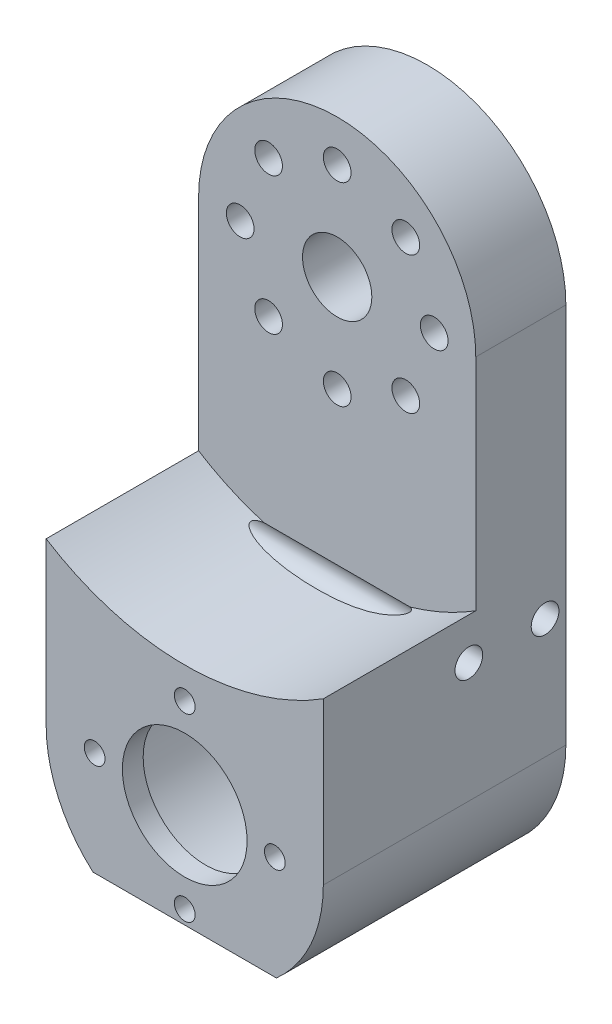
ISO-10303-21;
HEADER;
FILE_DESCRIPTION(('STEP AP214'),'2;1');
FILE_NAME('part.step','',(''),(''),'','','');
FILE_SCHEMA(('AUTOMOTIVE_DESIGN { 1 0 10303 214 1 1 1 1 }'));
ENDSEC;
DATA;
#1=APPLICATION_CONTEXT('core data for automotive mechanical design processes');
#2=APPLICATION_PROTOCOL_DEFINITION('international standard','automotive_design',2000,#1);
#3=PRODUCT_CONTEXT('',#1,'mechanical');
#4=PRODUCT('Part','Part','',(#3));
#5=PRODUCT_RELATED_PRODUCT_CATEGORY('part','',(#4));
#6=PRODUCT_DEFINITION_FORMATION('','',#4);
#7=PRODUCT_DEFINITION_CONTEXT('part definition',#1,'design');
#8=PRODUCT_DEFINITION('design','',#6,#7);
#9=PRODUCT_DEFINITION_SHAPE('','',#8);
#10=(LENGTH_UNIT() NAMED_UNIT(*) SI_UNIT(.MILLI.,.METRE.));
#11=(NAMED_UNIT(*) PLANE_ANGLE_UNIT() SI_UNIT($,.RADIAN.));
#12=(NAMED_UNIT(*) SI_UNIT($,.STERADIAN.) SOLID_ANGLE_UNIT());
#13=UNCERTAINTY_MEASURE_WITH_UNIT(LENGTH_MEASURE(1.E-05),#10,'distance_accuracy_value','');
#14=(GEOMETRIC_REPRESENTATION_CONTEXT(3) GLOBAL_UNCERTAINTY_ASSIGNED_CONTEXT((#13)) GLOBAL_UNIT_ASSIGNED_CONTEXT((#10,
#11,#12)) REPRESENTATION_CONTEXT('',''));
#15=CARTESIAN_POINT('',(0.,0.,0.));
#16=DIRECTION('',(0.,0.,1.));
#17=DIRECTION('',(1.,0.,0.));
#18=AXIS2_PLACEMENT_3D('',#15,#16,#17);
#19=CARTESIAN_POINT('',(0.,-75.,35.));
#20=DIRECTION('',(0.,0.,-1.));
#21=DIRECTION('',(-1.,0.,0.));
#22=AXIS2_PLACEMENT_3D('',#19,#20,#21);
#23=CYLINDRICAL_SURFACE('',#22,8.99999999999999);
#24=CARTESIAN_POINT('',(0.,-75.,35.));
#25=DIRECTION('',(0.,0.,1.));
#26=DIRECTION('',(1.,0.,0.));
#27=AXIS2_PLACEMENT_3D('',#24,#25,#26);
#28=CIRCLE('',#27,8.99999999999999);
#29=CARTESIAN_POINT('',(8.99999999999999,-75.,35.));
#30=VERTEX_POINT('',#29);
#31=EDGE_CURVE('E122',#30,#30,#28,.T.);
#32=ORIENTED_EDGE('',*,*,#31,.T.);
#33=EDGE_LOOP('',(#32));
#34=FACE_BOUND('',#33,.T.);
#35=CARTESIAN_POINT('',(0.,-75.,32.));
#36=DIRECTION('',(0.,0.,-1.));
#37=DIRECTION('',(-1.,0.,0.));
#38=AXIS2_PLACEMENT_3D('',#35,#36,#37);
#39=CIRCLE('',#38,8.99999999999999);
#40=CARTESIAN_POINT('',(-8.99999999999999,-75.,32.));
#41=VERTEX_POINT('',#40);
#42=EDGE_CURVE('E234',#41,#41,#39,.T.);
#43=ORIENTED_EDGE('',*,*,#42,.T.);
#44=EDGE_LOOP('',(#43));
#45=FACE_BOUND('',#44,.T.);
#46=ADVANCED_FACE('F33',(#34,#45),#23,.F.);
#47=CARTESIAN_POINT('',(0.,-62.,35.));
#48=DIRECTION('',(0.,0.,-1.));
#49=DIRECTION('',(-1.,0.,0.));
#50=AXIS2_PLACEMENT_3D('',#47,#48,#49);
#51=CYLINDRICAL_SURFACE('',#50,1.5);
#52=CARTESIAN_POINT('',(0.,-62.,35.));
#53=DIRECTION('',(0.,0.,1.));
#54=DIRECTION('',(1.,0.,0.));
#55=AXIS2_PLACEMENT_3D('',#52,#53,#54);
#56=CIRCLE('',#55,1.5);
#57=CARTESIAN_POINT('',(1.5,-62.,35.));
#58=VERTEX_POINT('',#57);
#59=EDGE_CURVE('E222',#58,#58,#56,.T.);
#60=ORIENTED_EDGE('',*,*,#59,.T.);
#61=EDGE_LOOP('',(#60));
#62=FACE_BOUND('',#61,.T.);
#63=CARTESIAN_POINT('',(0.,-62.,32.));
#64=DIRECTION('',(0.,0.,-1.));
#65=DIRECTION('',(-1.,0.,0.));
#66=AXIS2_PLACEMENT_3D('',#63,#64,#65);
#67=CIRCLE('',#66,1.5);
#68=CARTESIAN_POINT('',(-1.5,-62.,32.));
#69=VERTEX_POINT('',#68);
#70=EDGE_CURVE('E237',#69,#69,#67,.T.);
#71=ORIENTED_EDGE('',*,*,#70,.T.);
#72=EDGE_LOOP('',(#71));
#73=FACE_BOUND('',#72,.T.);
#74=ADVANCED_FACE('F274',(#62,#73),#51,.F.);
#75=CARTESIAN_POINT('',(0.,-88.,35.));
#76=DIRECTION('',(0.,0.,-1.));
#77=DIRECTION('',(-1.,0.,0.));
#78=AXIS2_PLACEMENT_3D('',#75,#76,#77);
#79=CYLINDRICAL_SURFACE('',#78,1.5);
#80=CARTESIAN_POINT('',(0.,-88.,35.));
#81=DIRECTION('',(0.,0.,1.));
#82=DIRECTION('',(1.,0.,0.));
#83=AXIS2_PLACEMENT_3D('',#80,#81,#82);
#84=CIRCLE('',#83,1.5);
#85=CARTESIAN_POINT('',(1.5,-88.,35.));
#86=VERTEX_POINT('',#85);
#87=EDGE_CURVE('E225',#86,#86,#84,.T.);
#88=ORIENTED_EDGE('',*,*,#87,.T.);
#89=EDGE_LOOP('',(#88));
#90=FACE_BOUND('',#89,.T.);
#91=CARTESIAN_POINT('',(0.,-88.,32.));
#92=DIRECTION('',(0.,0.,-1.));
#93=DIRECTION('',(-1.,0.,0.));
#94=AXIS2_PLACEMENT_3D('',#91,#92,#93);
#95=CIRCLE('',#94,1.5);
#96=CARTESIAN_POINT('',(-1.5,-88.,32.));
#97=VERTEX_POINT('',#96);
#98=EDGE_CURVE('E240',#97,#97,#95,.T.);
#99=ORIENTED_EDGE('',*,*,#98,.T.);
#100=EDGE_LOOP('',(#99));
#101=FACE_BOUND('',#100,.T.);
#102=ADVANCED_FACE('F280',(#90,#101),#79,.F.);
#103=CARTESIAN_POINT('',(-13.,-75.,35.));
#104=DIRECTION('',(0.,0.,-1.));
#105=DIRECTION('',(-1.,0.,0.));
#106=AXIS2_PLACEMENT_3D('',#103,#104,#105);
#107=CYLINDRICAL_SURFACE('',#106,1.5);
#108=CARTESIAN_POINT('',(-13.,-75.,35.));
#109=DIRECTION('',(0.,0.,1.));
#110=DIRECTION('',(1.,0.,0.));
#111=AXIS2_PLACEMENT_3D('',#108,#109,#110);
#112=CIRCLE('',#111,1.5);
#113=CARTESIAN_POINT('',(-11.5,-75.,35.));
#114=VERTEX_POINT('',#113);
#115=EDGE_CURVE('E228',#114,#114,#112,.T.);
#116=ORIENTED_EDGE('',*,*,#115,.T.);
#117=EDGE_LOOP('',(#116));
#118=FACE_BOUND('',#117,.T.);
#119=CARTESIAN_POINT('',(-13.,-75.,32.));
#120=DIRECTION('',(0.,0.,-1.));
#121=DIRECTION('',(-1.,0.,0.));
#122=AXIS2_PLACEMENT_3D('',#119,#120,#121);
#123=CIRCLE('',#122,1.5);
#124=CARTESIAN_POINT('',(-14.5,-75.,32.));
#125=VERTEX_POINT('',#124);
#126=EDGE_CURVE('E243',#125,#125,#123,.T.);
#127=ORIENTED_EDGE('',*,*,#126,.T.);
#128=EDGE_LOOP('',(#127));
#129=FACE_BOUND('',#128,.T.);
#130=ADVANCED_FACE('F392',(#118,#129),#107,.F.);
#131=CARTESIAN_POINT('',(13.,-75.,35.));
#132=DIRECTION('',(0.,0.,-1.));
#133=DIRECTION('',(-1.,0.,0.));
#134=AXIS2_PLACEMENT_3D('',#131,#132,#133);
#135=CYLINDRICAL_SURFACE('',#134,1.5);
#136=CARTESIAN_POINT('',(13.,-75.,35.));
#137=DIRECTION('',(0.,0.,1.));
#138=DIRECTION('',(1.,0.,0.));
#139=AXIS2_PLACEMENT_3D('',#136,#137,#138);
#140=CIRCLE('',#139,1.5);
#141=CARTESIAN_POINT('',(14.5,-75.,35.));
#142=VERTEX_POINT('',#141);
#143=EDGE_CURVE('E231',#142,#142,#140,.T.);
#144=ORIENTED_EDGE('',*,*,#143,.T.);
#145=EDGE_LOOP('',(#144));
#146=FACE_BOUND('',#145,.T.);
#147=CARTESIAN_POINT('',(13.,-75.,32.));
#148=DIRECTION('',(0.,0.,-1.));
#149=DIRECTION('',(-1.,0.,0.));
#150=AXIS2_PLACEMENT_3D('',#147,#148,#149);
#151=CIRCLE('',#150,1.5);
#152=CARTESIAN_POINT('',(11.5,-75.,32.));
#153=VERTEX_POINT('',#152);
#154=EDGE_CURVE('E246',#153,#153,#151,.T.);
#155=ORIENTED_EDGE('',*,*,#154,.T.);
#156=EDGE_LOOP('',(#155));
#157=FACE_BOUND('',#156,.T.);
#158=ADVANCED_FACE('F336',(#146,#157),#135,.F.);
#159=CARTESIAN_POINT('',(0.,-20.,13.));
#160=DIRECTION('',(0.,0.,1.));
#161=DIRECTION('',(1.,0.,0.));
#162=AXIS2_PLACEMENT_3D('',#159,#160,#161);
#163=PLANE('',#162);
#164=DIRECTION('',(-1.,0.,0.));
#165=VECTOR('',#164,1.);
#166=CARTESIAN_POINT('',(20.00105,-55.9893930435549,13.));
#167=LINE('',#166,#165);
#168=CARTESIAN_POINT('',(-10.53629860798,-55.9893930435549,13.));
#169=VERTEX_POINT('',#168);
#170=CARTESIAN_POINT('',(10.53629860798,-55.9893930435549,13.));
#171=VERTEX_POINT('',#170);
#172=EDGE_CURVE('E49',#169,#171,#167,.F.);
#173=ORIENTED_EDGE('',*,*,#172,.T.);
#174=CARTESIAN_POINT('',(0.,-20.,13.));
#175=DIRECTION('',(0.,0.,-1.));
#176=DIRECTION('',(1.,0.,0.));
#177=AXIS2_PLACEMENT_3D('',#174,#175,#176);
#178=CIRCLE('',#177,37.5);
#179=CARTESIAN_POINT('',(20.,-51.7214438511238,13.));
#180=VERTEX_POINT('',#179);
#181=EDGE_CURVE('E107',#180,#171,#178,.T.);
#182=ORIENTED_EDGE('',*,*,#181,.F.);
#183=DIRECTION('',(0.,1.,0.));
#184=VECTOR('',#183,1.);
#185=CARTESIAN_POINT('',(20.,-20.,13.));
#186=LINE('',#185,#184);
#187=CARTESIAN_POINT('',(20.,-20.,13.));
#188=VERTEX_POINT('',#187);
#189=EDGE_CURVE('E205',#180,#188,#186,.T.);
#190=ORIENTED_EDGE('',*,*,#189,.T.);
#191=CARTESIAN_POINT('',(0.,-20.,13.));
#192=DIRECTION('',(0.,0.,1.));
#193=DIRECTION('',(1.,0.,0.));
#194=AXIS2_PLACEMENT_3D('',#191,#192,#193);
#195=CIRCLE('',#194,20.);
#196=CARTESIAN_POINT('',(-20.,-20.,13.));
#197=VERTEX_POINT('',#196);
#198=EDGE_CURVE('E193',#188,#197,#195,.T.);
#199=ORIENTED_EDGE('',*,*,#198,.T.);
#200=DIRECTION('',(0.,-1.,0.));
#201=VECTOR('',#200,1.);
#202=CARTESIAN_POINT('',(-20.,-20.,13.));
#203=LINE('',#202,#201);
#204=CARTESIAN_POINT('',(-20.,-51.7214438511238,13.));
#205=VERTEX_POINT('',#204);
#206=EDGE_CURVE('E196',#197,#205,#203,.T.);
#207=ORIENTED_EDGE('',*,*,#206,.T.);
#208=EDGE_CURVE('E37',#169,#205,#178,.T.);
#209=ORIENTED_EDGE('',*,*,#208,.F.);
#210=EDGE_LOOP('',(#173,#182,#190,#199,#207,#209));
#211=FACE_BOUND('',#210,.T.);
#212=CARTESIAN_POINT('',(-1.42247325030098E-13,-34.,13.));
#213=DIRECTION('',(0.,0.,1.));
#214=DIRECTION('',(1.,0.,0.));
#215=AXIS2_PLACEMENT_3D('',#212,#213,#214);
#216=CIRCLE('',#215,2.);
#217=CARTESIAN_POINT('',(1.99999999999985,-34.,13.));
#218=VERTEX_POINT('',#217);
#219=EDGE_CURVE('E142',#218,#218,#216,.T.);
#220=ORIENTED_EDGE('',*,*,#219,.F.);
#221=EDGE_LOOP('',(#220));
#222=FACE_BOUND('',#221,.T.);
#223=CARTESIAN_POINT('',(14.,-20.0000000000001,13.));
#224=DIRECTION('',(0.,0.,1.));
#225=DIRECTION('',(1.,0.,0.));
#226=AXIS2_PLACEMENT_3D('',#223,#224,#225);
#227=CIRCLE('',#226,2.);
#228=CARTESIAN_POINT('',(16.,-20.0000000000001,13.));
#229=VERTEX_POINT('',#228);
#230=EDGE_CURVE('E154',#229,#229,#227,.T.);
#231=ORIENTED_EDGE('',*,*,#230,.F.);
#232=EDGE_LOOP('',(#231));
#233=FACE_BOUND('',#232,.T.);
#234=CARTESIAN_POINT('',(0.,-6.,13.));
#235=DIRECTION('',(0.,0.,1.));
#236=DIRECTION('',(1.,0.,0.));
#237=AXIS2_PLACEMENT_3D('',#234,#235,#236);
#238=CIRCLE('',#237,2.);
#239=CARTESIAN_POINT('',(2.00000000000005,-6.,13.));
#240=VERTEX_POINT('',#239);
#241=EDGE_CURVE('E166',#240,#240,#238,.T.);
#242=ORIENTED_EDGE('',*,*,#241,.F.);
#243=EDGE_LOOP('',(#242));
#244=FACE_BOUND('',#243,.T.);
#245=CARTESIAN_POINT('',(-14.,-20.,13.));
#246=DIRECTION('',(0.,0.,1.));
#247=DIRECTION('',(1.,0.,0.));
#248=AXIS2_PLACEMENT_3D('',#245,#246,#247);
#249=CIRCLE('',#248,2.);
#250=CARTESIAN_POINT('',(-12.,-20.,13.));
#251=VERTEX_POINT('',#250);
#252=EDGE_CURVE('E178',#251,#251,#249,.T.);
#253=ORIENTED_EDGE('',*,*,#252,.F.);
#254=EDGE_LOOP('',(#253));
#255=FACE_BOUND('',#254,.T.);
#256=CARTESIAN_POINT('',(0.,-20.,13.));
#257=DIRECTION('',(0.,0.,1.));
#258=DIRECTION('',(1.,0.,0.));
#259=AXIS2_PLACEMENT_3D('',#256,#257,#258);
#260=CIRCLE('',#259,5.);
#261=CARTESIAN_POINT('',(5.,-20.,13.));
#262=VERTEX_POINT('',#261);
#263=EDGE_CURVE('E184',#262,#262,#260,.T.);
#264=ORIENTED_EDGE('',*,*,#263,.F.);
#265=EDGE_LOOP('',(#264));
#266=FACE_BOUND('',#265,.T.);
#267=CARTESIAN_POINT('',(-9.89949493661165,-10.1005050633883,13.));
#268=DIRECTION('',(0.,0.,1.));
#269=DIRECTION('',(1.,0.,0.));
#270=AXIS2_PLACEMENT_3D('',#267,#268,#269);
#271=CIRCLE('',#270,2.);
#272=CARTESIAN_POINT('',(-7.89949493661165,-10.1005050633883,13.));
#273=VERTEX_POINT('',#272);
#274=EDGE_CURVE('E172',#273,#273,#271,.T.);
#275=ORIENTED_EDGE('',*,*,#274,.F.);
#276=EDGE_LOOP('',(#275));
#277=FACE_BOUND('',#276,.T.);
#278=CARTESIAN_POINT('',(9.89949493661171,-10.1005050633884,13.));
#279=DIRECTION('',(0.,0.,1.));
#280=DIRECTION('',(1.,0.,0.));
#281=AXIS2_PLACEMENT_3D('',#278,#279,#280);
#282=CIRCLE('',#281,2.);
#283=CARTESIAN_POINT('',(11.8994949366117,-10.1005050633884,13.));
#284=VERTEX_POINT('',#283);
#285=EDGE_CURVE('E160',#284,#284,#282,.T.);
#286=ORIENTED_EDGE('',*,*,#285,.F.);
#287=EDGE_LOOP('',(#286));
#288=FACE_BOUND('',#287,.T.);
#289=CARTESIAN_POINT('',(9.89949493661159,-29.8994949366118,13.));
#290=DIRECTION('',(0.,0.,1.));
#291=DIRECTION('',(1.,0.,0.));
#292=AXIS2_PLACEMENT_3D('',#289,#290,#291);
#293=CIRCLE('',#292,2.);
#294=CARTESIAN_POINT('',(11.8994949366116,-29.8994949366118,13.));
#295=VERTEX_POINT('',#294);
#296=EDGE_CURVE('E148',#295,#295,#293,.T.);
#297=ORIENTED_EDGE('',*,*,#296,.F.);
#298=EDGE_LOOP('',(#297));
#299=FACE_BOUND('',#298,.T.);
#300=CARTESIAN_POINT('',(-9.89949493661179,-29.8994949366115,13.));
#301=DIRECTION('',(0.,0.,1.));
#302=DIRECTION('',(1.,0.,0.));
#303=AXIS2_PLACEMENT_3D('',#300,#301,#302);
#304=CIRCLE('',#303,2.);
#305=CARTESIAN_POINT('',(-7.89949493661178,-29.8994949366115,13.));
#306=VERTEX_POINT('',#305);
#307=EDGE_CURVE('E133',#306,#306,#304,.T.);
#308=ORIENTED_EDGE('',*,*,#307,.F.);
#309=EDGE_LOOP('',(#308));
#310=FACE_BOUND('',#309,.T.);
#311=ADVANCED_FACE('F105',(#211,#222,#233,#244,#255,#266,#277,#288,#299,#310),#163,.T.);
#312=CARTESIAN_POINT('',(0.,-20.,0.));
#313=DIRECTION('',(0.,0.,1.));
#314=DIRECTION('',(1.,0.,0.));
#315=AXIS2_PLACEMENT_3D('',#312,#313,#314);
#316=PLANE('',#315);
#317=CARTESIAN_POINT('',(-1.42247325030098E-13,-34.,0.));
#318=DIRECTION('',(0.,0.,1.));
#319=DIRECTION('',(1.,0.,0.));
#320=AXIS2_PLACEMENT_3D('',#317,#318,#319);
#321=CIRCLE('',#320,2.);
#322=CARTESIAN_POINT('',(1.99999999999985,-34.,0.));
#323=VERTEX_POINT('',#322);
#324=EDGE_CURVE('E137',#323,#323,#321,.T.);
#325=ORIENTED_EDGE('',*,*,#324,.T.);
#326=EDGE_LOOP('',(#325));
#327=FACE_BOUND('',#326,.T.);
#328=CARTESIAN_POINT('',(14.,-20.0000000000001,0.));
#329=DIRECTION('',(0.,0.,1.));
#330=DIRECTION('',(1.,0.,0.));
#331=AXIS2_PLACEMENT_3D('',#328,#329,#330);
#332=CIRCLE('',#331,2.);
#333=CARTESIAN_POINT('',(16.,-20.0000000000001,0.));
#334=VERTEX_POINT('',#333);
#335=EDGE_CURVE('E151',#334,#334,#332,.T.);
#336=ORIENTED_EDGE('',*,*,#335,.T.);
#337=EDGE_LOOP('',(#336));
#338=FACE_BOUND('',#337,.T.);
#339=CARTESIAN_POINT('',(0.,-6.,0.));
#340=DIRECTION('',(0.,0.,1.));
#341=DIRECTION('',(1.,0.,0.));
#342=AXIS2_PLACEMENT_3D('',#339,#340,#341);
#343=CIRCLE('',#342,2.);
#344=CARTESIAN_POINT('',(2.00000000000005,-6.,0.));
#345=VERTEX_POINT('',#344);
#346=EDGE_CURVE('E163',#345,#345,#343,.T.);
#347=ORIENTED_EDGE('',*,*,#346,.T.);
#348=EDGE_LOOP('',(#347));
#349=FACE_BOUND('',#348,.T.);
#350=CARTESIAN_POINT('',(-14.,-20.,0.));
#351=DIRECTION('',(0.,0.,1.));
#352=DIRECTION('',(1.,0.,0.));
#353=AXIS2_PLACEMENT_3D('',#350,#351,#352);
#354=CIRCLE('',#353,2.);
#355=CARTESIAN_POINT('',(-12.,-20.,0.));
#356=VERTEX_POINT('',#355);
#357=EDGE_CURVE('E175',#356,#356,#354,.T.);
#358=ORIENTED_EDGE('',*,*,#357,.T.);
#359=EDGE_LOOP('',(#358));
#360=FACE_BOUND('',#359,.T.);
#361=CARTESIAN_POINT('',(0.,-75.,0.));
#362=DIRECTION('',(0.,0.,1.));
#363=DIRECTION('',(1.,0.,0.));
#364=AXIS2_PLACEMENT_3D('',#361,#362,#363);
#365=CIRCLE('',#364,15.);
#366=CARTESIAN_POINT('',(15.,-75.,0.));
#367=VERTEX_POINT('',#366);
#368=EDGE_CURVE('E187',#367,#367,#365,.T.);
#369=ORIENTED_EDGE('',*,*,#368,.T.);
#370=EDGE_LOOP('',(#369));
#371=FACE_BOUND('',#370,.T.);
#372=CARTESIAN_POINT('',(0.,-20.,0.));
#373=DIRECTION('',(0.,0.,1.));
#374=DIRECTION('',(1.,0.,0.));
#375=AXIS2_PLACEMENT_3D('',#372,#373,#374);
#376=CIRCLE('',#375,20.);
#377=CARTESIAN_POINT('',(20.,-20.,0.));
#378=VERTEX_POINT('',#377);
#379=CARTESIAN_POINT('',(-20.,-20.,0.));
#380=VERTEX_POINT('',#379);
#381=EDGE_CURVE('E192',#378,#380,#376,.T.);
#382=ORIENTED_EDGE('',*,*,#381,.F.);
#383=DIRECTION('',(0.,1.,0.));
#384=VECTOR('',#383,1.);
#385=CARTESIAN_POINT('',(20.,-20.,0.));
#386=LINE('',#385,#384);
#387=CARTESIAN_POINT('',(20.,-75.,0.));
#388=VERTEX_POINT('',#387);
#389=EDGE_CURVE('E197',#388,#378,#386,.T.);
#390=ORIENTED_EDGE('',*,*,#389,.F.);
#391=CARTESIAN_POINT('',(0.,-75.,0.));
#392=DIRECTION('',(0.,0.,1.));
#393=DIRECTION('',(1.,0.,0.));
#394=AXIS2_PLACEMENT_3D('',#391,#392,#393);
#395=CIRCLE('',#394,20.);
#396=CARTESIAN_POINT('',(-20.,-75.,0.));
#397=VERTEX_POINT('',#396);
#398=EDGE_CURVE('E367',#397,#388,#395,.T.);
#399=ORIENTED_EDGE('',*,*,#398,.F.);
#400=DIRECTION('',(0.,-1.,0.));
#401=VECTOR('',#400,1.);
#402=CARTESIAN_POINT('',(-20.,-20.,0.));
#403=LINE('',#402,#401);
#404=EDGE_CURVE('E359',#380,#397,#403,.T.);
#405=ORIENTED_EDGE('',*,*,#404,.F.);
#406=EDGE_LOOP('',(#382,#390,#399,#405));
#407=FACE_BOUND('',#406,.T.);
#408=CARTESIAN_POINT('',(0.,-20.,0.));
#409=DIRECTION('',(0.,0.,1.));
#410=DIRECTION('',(1.,0.,0.));
#411=AXIS2_PLACEMENT_3D('',#408,#409,#410);
#412=CIRCLE('',#411,5.);
#413=CARTESIAN_POINT('',(5.,-20.,0.));
#414=VERTEX_POINT('',#413);
#415=EDGE_CURVE('E181',#414,#414,#412,.T.);
#416=ORIENTED_EDGE('',*,*,#415,.T.);
#417=EDGE_LOOP('',(#416));
#418=FACE_BOUND('',#417,.T.);
#419=CARTESIAN_POINT('',(-9.89949493661165,-10.1005050633883,0.));
#420=DIRECTION('',(0.,0.,1.));
#421=DIRECTION('',(1.,0.,0.));
#422=AXIS2_PLACEMENT_3D('',#419,#420,#421);
#423=CIRCLE('',#422,2.);
#424=CARTESIAN_POINT('',(-7.89949493661165,-10.1005050633883,0.));
#425=VERTEX_POINT('',#424);
#426=EDGE_CURVE('E169',#425,#425,#423,.T.);
#427=ORIENTED_EDGE('',*,*,#426,.T.);
#428=EDGE_LOOP('',(#427));
#429=FACE_BOUND('',#428,.T.);
#430=CARTESIAN_POINT('',(9.89949493661171,-10.1005050633884,0.));
#431=DIRECTION('',(0.,0.,1.));
#432=DIRECTION('',(1.,0.,0.));
#433=AXIS2_PLACEMENT_3D('',#430,#431,#432);
#434=CIRCLE('',#433,2.);
#435=CARTESIAN_POINT('',(11.8994949366117,-10.1005050633884,0.));
#436=VERTEX_POINT('',#435);
#437=EDGE_CURVE('E157',#436,#436,#434,.T.);
#438=ORIENTED_EDGE('',*,*,#437,.T.);
#439=EDGE_LOOP('',(#438));
#440=FACE_BOUND('',#439,.T.);
#441=CARTESIAN_POINT('',(9.89949493661159,-29.8994949366118,0.));
#442=DIRECTION('',(0.,0.,1.));
#443=DIRECTION('',(1.,0.,0.));
#444=AXIS2_PLACEMENT_3D('',#441,#442,#443);
#445=CIRCLE('',#444,2.);
#446=CARTESIAN_POINT('',(11.8994949366116,-29.8994949366118,0.));
#447=VERTEX_POINT('',#446);
#448=EDGE_CURVE('E145',#447,#447,#445,.T.);
#449=ORIENTED_EDGE('',*,*,#448,.T.);
#450=EDGE_LOOP('',(#449));
#451=FACE_BOUND('',#450,.T.);
#452=CARTESIAN_POINT('',(-9.89949493661179,-29.8994949366115,0.));
#453=DIRECTION('',(0.,0.,1.));
#454=DIRECTION('',(1.,0.,0.));
#455=AXIS2_PLACEMENT_3D('',#452,#453,#454);
#456=CIRCLE('',#455,2.);
#457=CARTESIAN_POINT('',(-7.89949493661178,-29.8994949366115,0.));
#458=VERTEX_POINT('',#457);
#459=EDGE_CURVE('E138',#458,#458,#456,.T.);
#460=ORIENTED_EDGE('',*,*,#459,.T.);
#461=EDGE_LOOP('',(#460));
#462=FACE_BOUND('',#461,.T.);
#463=ADVANCED_FACE('F335',(#327,#338,#349,#360,#371,#407,#418,#429,#440,#451,#462),#316,.F.);
#464=CARTESIAN_POINT('',(0.,-20.,13.));
#465=DIRECTION('',(0.,0.,-1.));
#466=DIRECTION('',(-1.,0.,0.));
#467=AXIS2_PLACEMENT_3D('',#464,#465,#466);
#468=CYLINDRICAL_SURFACE('',#467,20.);
#469=ORIENTED_EDGE('',*,*,#381,.T.);
#470=DIRECTION('',(0.,0.,-1.));
#471=VECTOR('',#470,1.);
#472=CARTESIAN_POINT('',(-20.,-20.,13.));
#473=LINE('',#472,#471);
#474=EDGE_CURVE('E43',#197,#380,#473,.T.);
#475=ORIENTED_EDGE('',*,*,#474,.F.);
#476=ORIENTED_EDGE('',*,*,#198,.F.);
#477=DIRECTION('',(0.,0.,-1.));
#478=VECTOR('',#477,1.);
#479=CARTESIAN_POINT('',(20.,-20.,13.));
#480=LINE('',#479,#478);
#481=EDGE_CURVE('E207',#188,#378,#480,.T.);
#482=ORIENTED_EDGE('',*,*,#481,.T.);
#483=EDGE_LOOP('',(#469,#475,#476,#482));
#484=FACE_BOUND('',#483,.T.);
#485=ADVANCED_FACE('F35',(#484),#468,.T.);
#486=CARTESIAN_POINT('',(-20.,-20.,13.));
#487=DIRECTION('',(1.,0.,0.));
#488=DIRECTION('',(0.,1.,0.));
#489=AXIS2_PLACEMENT_3D('',#486,#487,#488);
#490=PLANE('',#489);
#491=CARTESIAN_POINT('',(-20.,-57.7214438511238,2.99999999999999));
#492=DIRECTION('',(-1.,0.,0.));
#493=DIRECTION('',(0.,-1.,0.));
#494=AXIS2_PLACEMENT_3D('',#491,#492,#493);
#495=CIRCLE('',#494,2.);
#496=CARTESIAN_POINT('',(-20.,-59.7214438511238,2.99999999999999));
#497=VERTEX_POINT('',#496);
#498=EDGE_CURVE('E355',#497,#497,#495,.T.);
#499=ORIENTED_EDGE('',*,*,#498,.F.);
#500=EDGE_LOOP('',(#499));
#501=FACE_BOUND('',#500,.T.);
#502=CARTESIAN_POINT('',(-20.,-57.7214438511238,14.));
#503=DIRECTION('',(-1.,0.,0.));
#504=DIRECTION('',(0.,-1.,0.));
#505=AXIS2_PLACEMENT_3D('',#502,#503,#504);
#506=CIRCLE('',#505,2.);
#507=CARTESIAN_POINT('',(-20.,-59.7214438511238,14.));
#508=VERTEX_POINT('',#507);
#509=EDGE_CURVE('E102',#508,#508,#506,.T.);
#510=ORIENTED_EDGE('',*,*,#509,.F.);
#511=EDGE_LOOP('',(#510));
#512=FACE_BOUND('',#511,.T.);
#513=ORIENTED_EDGE('',*,*,#404,.T.);
#514=DIRECTION('',(0.,0.,-1.));
#515=VECTOR('',#514,1.);
#516=CARTESIAN_POINT('',(-20.,-75.,13.));
#517=LINE('',#516,#515);
#518=CARTESIAN_POINT('',(-20.,-75.,35.));
#519=VERTEX_POINT('',#518);
#520=EDGE_CURVE('E361',#519,#397,#517,.T.);
#521=ORIENTED_EDGE('',*,*,#520,.F.);
#522=DIRECTION('',(0.,-1.,0.));
#523=VECTOR('',#522,1.);
#524=CARTESIAN_POINT('',(-20.,-75.,35.));
#525=LINE('',#524,#523);
#526=CARTESIAN_POINT('',(-20.,-51.7214438511238,35.));
#527=VERTEX_POINT('',#526);
#528=EDGE_CURVE('E120',#527,#519,#525,.T.);
#529=ORIENTED_EDGE('',*,*,#528,.F.);
#530=DIRECTION('',(0.,0.,-1.));
#531=VECTOR('',#530,1.);
#532=CARTESIAN_POINT('',(-20.,-51.7214438511238,35.));
#533=LINE('',#532,#531);
#534=EDGE_CURVE('E141',#527,#205,#533,.T.);
#535=ORIENTED_EDGE('',*,*,#534,.T.);
#536=ORIENTED_EDGE('',*,*,#206,.F.);
#537=ORIENTED_EDGE('',*,*,#474,.T.);
#538=EDGE_LOOP('',(#513,#521,#529,#535,#536,#537));
#539=FACE_BOUND('',#538,.T.);
#540=ADVANCED_FACE('F345',(#501,#512,#539),#490,.F.);
#541=CARTESIAN_POINT('',(0.,-75.,13.));
#542=DIRECTION('',(0.,0.,-1.));
#543=DIRECTION('',(-1.,0.,0.));
#544=AXIS2_PLACEMENT_3D('',#541,#542,#543);
#545=CYLINDRICAL_SURFACE('',#544,20.);
#546=CARTESIAN_POINT('',(0.,-75.,50.));
#547=DIRECTION('',(0.,0.707106781186547,-0.707106781186548));
#548=DIRECTION('',(0.,-0.707106781186548,-0.707106781186547));
#549=AXIS2_PLACEMENT_3D('',#546,#547,#548);
#550=ELLIPSE('',#549,28.2842712474619,20.);
#551=CARTESIAN_POINT('',(13.228756555323,-90.,35.));
#552=VERTEX_POINT('',#551);
#553=CARTESIAN_POINT('',(-13.228756555323,-90.,35.));
#554=VERTEX_POINT('',#553);
#555=EDGE_CURVE('E55',#552,#554,#550,.T.);
#556=ORIENTED_EDGE('',*,*,#555,.T.);
#557=CARTESIAN_POINT('',(0.,-75.,35.));
#558=DIRECTION('',(0.,0.,1.));
#559=DIRECTION('',(1.,0.,0.));
#560=AXIS2_PLACEMENT_3D('',#557,#558,#559);
#561=CIRCLE('',#560,20.);
#562=EDGE_CURVE('E211',#519,#554,#561,.T.);
#563=ORIENTED_EDGE('',*,*,#562,.F.);
#564=ORIENTED_EDGE('',*,*,#520,.T.);
#565=ORIENTED_EDGE('',*,*,#398,.T.);
#566=DIRECTION('',(0.,0.,-1.));
#567=VECTOR('',#566,1.);
#568=CARTESIAN_POINT('',(20.,-75.,13.));
#569=LINE('',#568,#567);
#570=CARTESIAN_POINT('',(20.,-75.,35.));
#571=VERTEX_POINT('',#570);
#572=EDGE_CURVE('E371',#571,#388,#569,.T.);
#573=ORIENTED_EDGE('',*,*,#572,.F.);
#574=EDGE_CURVE('E215',#552,#571,#561,.T.);
#575=ORIENTED_EDGE('',*,*,#574,.F.);
#576=EDGE_LOOP('',(#556,#563,#564,#565,#573,#575));
#577=FACE_BOUND('',#576,.T.);
#578=ADVANCED_FACE('F342',(#577),#545,.T.);
#579=CARTESIAN_POINT('',(20.,-20.,13.));
#580=DIRECTION('',(-1.,0.,0.));
#581=DIRECTION('',(0.,-1.,0.));
#582=AXIS2_PLACEMENT_3D('',#579,#580,#581);
#583=PLANE('',#582);
#584=CARTESIAN_POINT('',(20.,-57.7214438511238,2.99999999999999));
#585=DIRECTION('',(-1.,0.,0.));
#586=DIRECTION('',(0.,-1.,0.));
#587=AXIS2_PLACEMENT_3D('',#584,#585,#586);
#588=CIRCLE('',#587,2.);
#589=CARTESIAN_POINT('',(20.,-59.7214438511238,2.99999999999999));
#590=VERTEX_POINT('',#589);
#591=EDGE_CURVE('E607',#590,#590,#588,.F.);
#592=ORIENTED_EDGE('',*,*,#591,.F.);
#593=EDGE_LOOP('',(#592));
#594=FACE_BOUND('',#593,.T.);
#595=CARTESIAN_POINT('',(20.,-57.7214438511238,14.));
#596=DIRECTION('',(-1.,0.,0.));
#597=DIRECTION('',(0.,-1.,0.));
#598=AXIS2_PLACEMENT_3D('',#595,#596,#597);
#599=CIRCLE('',#598,2.);
#600=CARTESIAN_POINT('',(20.,-59.7214438511238,14.));
#601=VERTEX_POINT('',#600);
#602=EDGE_CURVE('E110',#601,#601,#599,.F.);
#603=ORIENTED_EDGE('',*,*,#602,.F.);
#604=EDGE_LOOP('',(#603));
#605=FACE_BOUND('',#604,.T.);
#606=ORIENTED_EDGE('',*,*,#389,.T.);
#607=ORIENTED_EDGE('',*,*,#481,.F.);
#608=ORIENTED_EDGE('',*,*,#189,.F.);
#609=DIRECTION('',(0.,0.,-1.));
#610=VECTOR('',#609,1.);
#611=CARTESIAN_POINT('',(20.,-51.7214438511238,35.));
#612=LINE('',#611,#610);
#613=CARTESIAN_POINT('',(20.,-51.7214438511238,35.));
#614=VERTEX_POINT('',#613);
#615=EDGE_CURVE('E116',#614,#180,#612,.T.);
#616=ORIENTED_EDGE('',*,*,#615,.F.);
#617=DIRECTION('',(0.,1.,0.));
#618=VECTOR('',#617,1.);
#619=CARTESIAN_POINT('',(20.,-75.,35.));
#620=LINE('',#619,#618);
#621=EDGE_CURVE('E131',#571,#614,#620,.T.);
#622=ORIENTED_EDGE('',*,*,#621,.F.);
#623=ORIENTED_EDGE('',*,*,#572,.T.);
#624=EDGE_LOOP('',(#606,#607,#608,#616,#622,#623));
#625=FACE_BOUND('',#624,.T.);
#626=ADVANCED_FACE('F331',(#594,#605,#625),#583,.F.);
#627=CARTESIAN_POINT('',(0.,-75.,13.));
#628=DIRECTION('',(0.,0.,-1.));
#629=DIRECTION('',(-1.,0.,0.));
#630=AXIS2_PLACEMENT_3D('',#627,#628,#629);
#631=CYLINDRICAL_SURFACE('',#630,15.);
#632=ORIENTED_EDGE('',*,*,#368,.F.);
#633=EDGE_LOOP('',(#632));
#634=FACE_BOUND('',#633,.T.);
#635=CARTESIAN_POINT('',(0.,-75.,32.));
#636=DIRECTION('',(0.,0.,-1.));
#637=DIRECTION('',(-1.,0.,0.));
#638=AXIS2_PLACEMENT_3D('',#635,#636,#637);
#639=CIRCLE('',#638,15.);
#640=CARTESIAN_POINT('',(-15.,-75.,32.));
#641=VERTEX_POINT('',#640);
#642=EDGE_CURVE('E247',#641,#641,#639,.T.);
#643=ORIENTED_EDGE('',*,*,#642,.F.);
#644=EDGE_LOOP('',(#643));
#645=FACE_BOUND('',#644,.T.);
#646=ADVANCED_FACE('F327',(#634,#645),#631,.F.);
#647=CARTESIAN_POINT('',(0.,-20.,13.));
#648=DIRECTION('',(0.,0.,-1.));
#649=DIRECTION('',(-1.,0.,0.));
#650=AXIS2_PLACEMENT_3D('',#647,#648,#649);
#651=CYLINDRICAL_SURFACE('',#650,5.);
#652=ORIENTED_EDGE('',*,*,#263,.T.);
#653=EDGE_LOOP('',(#652));
#654=FACE_BOUND('',#653,.T.);
#655=ORIENTED_EDGE('',*,*,#415,.F.);
#656=EDGE_LOOP('',(#655));
#657=FACE_BOUND('',#656,.T.);
#658=ADVANCED_FACE('F323',(#654,#657),#651,.F.);
#659=CARTESIAN_POINT('',(-14.,-20.,13.));
#660=DIRECTION('',(0.,0.,-1.));
#661=DIRECTION('',(-1.,0.,0.));
#662=AXIS2_PLACEMENT_3D('',#659,#660,#661);
#663=CYLINDRICAL_SURFACE('',#662,2.);
#664=ORIENTED_EDGE('',*,*,#252,.T.);
#665=EDGE_LOOP('',(#664));
#666=FACE_BOUND('',#665,.T.);
#667=ORIENTED_EDGE('',*,*,#357,.F.);
#668=EDGE_LOOP('',(#667));
#669=FACE_BOUND('',#668,.T.);
#670=ADVANCED_FACE('F319',(#666,#669),#663,.F.);
#671=CARTESIAN_POINT('',(-9.89949493661165,-10.1005050633883,13.));
#672=DIRECTION('',(0.,0.,-1.));
#673=DIRECTION('',(-1.,0.,0.));
#674=AXIS2_PLACEMENT_3D('',#671,#672,#673);
#675=CYLINDRICAL_SURFACE('',#674,2.);
#676=ORIENTED_EDGE('',*,*,#274,.T.);
#677=EDGE_LOOP('',(#676));
#678=FACE_BOUND('',#677,.T.);
#679=ORIENTED_EDGE('',*,*,#426,.F.);
#680=EDGE_LOOP('',(#679));
#681=FACE_BOUND('',#680,.T.);
#682=ADVANCED_FACE('F315',(#678,#681),#675,.F.);
#683=CARTESIAN_POINT('',(0.,-6.,13.));
#684=DIRECTION('',(0.,0.,-1.));
#685=DIRECTION('',(-1.,0.,0.));
#686=AXIS2_PLACEMENT_3D('',#683,#684,#685);
#687=CYLINDRICAL_SURFACE('',#686,2.);
#688=ORIENTED_EDGE('',*,*,#241,.T.);
#689=EDGE_LOOP('',(#688));
#690=FACE_BOUND('',#689,.T.);
#691=ORIENTED_EDGE('',*,*,#346,.F.);
#692=EDGE_LOOP('',(#691));
#693=FACE_BOUND('',#692,.T.);
#694=ADVANCED_FACE('F311',(#690,#693),#687,.F.);
#695=CARTESIAN_POINT('',(9.89949493661171,-10.1005050633884,13.));
#696=DIRECTION('',(0.,0.,-1.));
#697=DIRECTION('',(-1.,0.,0.));
#698=AXIS2_PLACEMENT_3D('',#695,#696,#697);
#699=CYLINDRICAL_SURFACE('',#698,2.);
#700=ORIENTED_EDGE('',*,*,#285,.T.);
#701=EDGE_LOOP('',(#700));
#702=FACE_BOUND('',#701,.T.);
#703=ORIENTED_EDGE('',*,*,#437,.F.);
#704=EDGE_LOOP('',(#703));
#705=FACE_BOUND('',#704,.T.);
#706=ADVANCED_FACE('F307',(#702,#705),#699,.F.);
#707=CARTESIAN_POINT('',(14.,-20.0000000000001,13.));
#708=DIRECTION('',(0.,0.,-1.));
#709=DIRECTION('',(-1.,0.,0.));
#710=AXIS2_PLACEMENT_3D('',#707,#708,#709);
#711=CYLINDRICAL_SURFACE('',#710,2.);
#712=ORIENTED_EDGE('',*,*,#230,.T.);
#713=EDGE_LOOP('',(#712));
#714=FACE_BOUND('',#713,.T.);
#715=ORIENTED_EDGE('',*,*,#335,.F.);
#716=EDGE_LOOP('',(#715));
#717=FACE_BOUND('',#716,.T.);
#718=ADVANCED_FACE('F303',(#714,#717),#711,.F.);
#719=CARTESIAN_POINT('',(9.89949493661159,-29.8994949366118,13.));
#720=DIRECTION('',(0.,0.,-1.));
#721=DIRECTION('',(-1.,0.,0.));
#722=AXIS2_PLACEMENT_3D('',#719,#720,#721);
#723=CYLINDRICAL_SURFACE('',#722,2.);
#724=ORIENTED_EDGE('',*,*,#296,.T.);
#725=EDGE_LOOP('',(#724));
#726=FACE_BOUND('',#725,.T.);
#727=ORIENTED_EDGE('',*,*,#448,.F.);
#728=EDGE_LOOP('',(#727));
#729=FACE_BOUND('',#728,.T.);
#730=ADVANCED_FACE('F299',(#726,#729),#723,.F.);
#731=CARTESIAN_POINT('',(-1.42247325030098E-13,-34.,13.));
#732=DIRECTION('',(0.,0.,-1.));
#733=DIRECTION('',(-1.,0.,0.));
#734=AXIS2_PLACEMENT_3D('',#731,#732,#733);
#735=CYLINDRICAL_SURFACE('',#734,2.);
#736=ORIENTED_EDGE('',*,*,#219,.T.);
#737=EDGE_LOOP('',(#736));
#738=FACE_BOUND('',#737,.T.);
#739=ORIENTED_EDGE('',*,*,#324,.F.);
#740=EDGE_LOOP('',(#739));
#741=FACE_BOUND('',#740,.T.);
#742=ADVANCED_FACE('F295',(#738,#741),#735,.F.);
#743=CARTESIAN_POINT('',(-9.89949493661179,-29.8994949366115,13.));
#744=DIRECTION('',(0.,0.,-1.));
#745=DIRECTION('',(-1.,0.,0.));
#746=AXIS2_PLACEMENT_3D('',#743,#744,#745);
#747=CYLINDRICAL_SURFACE('',#746,2.);
#748=ORIENTED_EDGE('',*,*,#307,.T.);
#749=EDGE_LOOP('',(#748));
#750=FACE_BOUND('',#749,.T.);
#751=ORIENTED_EDGE('',*,*,#459,.F.);
#752=EDGE_LOOP('',(#751));
#753=FACE_BOUND('',#752,.T.);
#754=ADVANCED_FACE('F289',(#750,#753),#747,.F.);
#755=CARTESIAN_POINT('',(0.,-20.,35.));
#756=DIRECTION('',(0.,0.,1.));
#757=DIRECTION('',(1.,0.,0.));
#758=AXIS2_PLACEMENT_3D('',#755,#756,#757);
#759=PLANE('',#758);
#760=DIRECTION('',(-1.,0.,0.));
#761=VECTOR('',#760,1.);
#762=CARTESIAN_POINT('',(0.,-90.,35.));
#763=LINE('',#762,#761);
#764=EDGE_CURVE('E11',#552,#554,#763,.T.);
#765=ORIENTED_EDGE('',*,*,#764,.F.);
#766=ORIENTED_EDGE('',*,*,#574,.T.);
#767=ORIENTED_EDGE('',*,*,#621,.T.);
#768=CARTESIAN_POINT('',(0.,-20.,35.));
#769=DIRECTION('',(0.,0.,-1.));
#770=DIRECTION('',(1.,0.,0.));
#771=AXIS2_PLACEMENT_3D('',#768,#769,#770);
#772=CIRCLE('',#771,37.5);
#773=EDGE_CURVE('E117',#614,#527,#772,.T.);
#774=ORIENTED_EDGE('',*,*,#773,.T.);
#775=ORIENTED_EDGE('',*,*,#528,.T.);
#776=ORIENTED_EDGE('',*,*,#562,.T.);
#777=EDGE_LOOP('',(#765,#766,#767,#774,#775,#776));
#778=FACE_BOUND('',#777,.T.);
#779=ORIENTED_EDGE('',*,*,#115,.F.);
#780=EDGE_LOOP('',(#779));
#781=FACE_BOUND('',#780,.T.);
#782=ORIENTED_EDGE('',*,*,#59,.F.);
#783=EDGE_LOOP('',(#782));
#784=FACE_BOUND('',#783,.T.);
#785=ORIENTED_EDGE('',*,*,#31,.F.);
#786=EDGE_LOOP('',(#785));
#787=FACE_BOUND('',#786,.T.);
#788=ORIENTED_EDGE('',*,*,#87,.F.);
#789=EDGE_LOOP('',(#788));
#790=FACE_BOUND('',#789,.T.);
#791=ORIENTED_EDGE('',*,*,#143,.F.);
#792=EDGE_LOOP('',(#791));
#793=FACE_BOUND('',#792,.T.);
#794=ADVANCED_FACE('F286',(#778,#781,#784,#787,#790,#793),#759,.T.);
#795=CARTESIAN_POINT('',(0.,-20.,35.));
#796=DIRECTION('',(0.,0.,-1.));
#797=DIRECTION('',(-1.,0.,0.));
#798=AXIS2_PLACEMENT_3D('',#795,#796,#797);
#799=CYLINDRICAL_SURFACE('',#798,37.5);
#800=ORIENTED_EDGE('',*,*,#181,.T.);
#801=CARTESIAN_POINT('',(-10.53629860798,-55.9893930435549,13.));
#802=CARTESIAN_POINT('',(-10.5806434161121,-55.9764113968337,13.0225060051042));
#803=CARTESIAN_POINT('',(-10.6245604296392,-55.9634644270457,13.0459234679248));
#804=CARTESIAN_POINT('',(-10.711342792523,-55.937712431417,13.0949680457407));
#805=CARTESIAN_POINT('',(-10.7542051002651,-55.924907863854,13.1206007645013));
#806=CARTESIAN_POINT('',(-10.8392021879976,-55.8993551841045,13.1748301337593));
#807=CARTESIAN_POINT('',(-10.8813101689948,-55.8866121949087,13.2034716642914));
#808=CARTESIAN_POINT('',(-10.9634300126958,-55.8616095698164,13.2637388493666));
#809=CARTESIAN_POINT('',(-11.0034441280902,-55.8493494181252,13.2953611898938));
#810=CARTESIAN_POINT('',(-11.0845341751301,-55.8243642435189,13.365482271582));
#811=CARTESIAN_POINT('',(-11.1253173149098,-55.811715000728,13.4043523355644));
#812=CARTESIAN_POINT('',(-11.201802143372,-55.787864165379,13.4870541715549));
#813=CARTESIAN_POINT('',(-11.237522712381,-55.7766572091659,13.5308663517183));
#814=CARTESIAN_POINT('',(-11.293722339909,-55.7589497250061,13.6128078936204));
#815=CARTESIAN_POINT('',(-11.3157948671004,-55.7519676277428,13.649724126194));
#816=CARTESIAN_POINT('',(-11.354121750743,-55.7398142815057,13.7267672197079));
#817=CARTESIAN_POINT('',(-11.3703849441796,-55.7346402823693,13.7668890895673));
#818=CARTESIAN_POINT('',(-11.3930774398304,-55.7274110828859,13.8419560343014));
#819=CARTESIAN_POINT('',(-11.4007737705491,-55.7249546069766,13.8764744763729));
#820=CARTESIAN_POINT('',(-11.4104743343544,-55.7218574977688,13.9463820097929));
#821=CARTESIAN_POINT('',(-11.412482789383,-55.7212155176245,13.9817704356861));
#822=CARTESIAN_POINT('',(-11.4105967193777,-55.7218180247462,14.05238656131));
#823=CARTESIAN_POINT('',(-11.4066992893498,-55.7230634403868,14.0876141733891));
#824=CARTESIAN_POINT('',(-11.393407253059,-55.7273049399515,14.1569046846173));
#825=CARTESIAN_POINT('',(-11.3840078021341,-55.7303025667363,14.1909665292676));
#826=CARTESIAN_POINT('',(-11.3566074469585,-55.7390225509359,14.268298479236));
#827=CARTESIAN_POINT('',(-11.3367834366814,-55.7453201874894,14.3108513974723));
#828=CARTESIAN_POINT('',(-11.2909563608294,-55.7598222266746,14.3921152334459));
#829=CARTESIAN_POINT('',(-11.2649391782874,-55.7680309846411,14.4308170828385));
#830=CARTESIAN_POINT('',(-11.189188016782,-55.7918219623545,14.5297718807235));
#831=CARTESIAN_POINT('',(-11.1354224000932,-55.8086011530249,14.5866104322114));
#832=CARTESIAN_POINT('',(-11.0207438061252,-55.8440631332504,14.6917504032865));
#833=CARTESIAN_POINT('',(-10.9598106721577,-55.8627512708179,14.7400267408403));
#834=CARTESIAN_POINT('',(-10.8106409603926,-55.90805052411,14.8461969877001));
#835=CARTESIAN_POINT('',(-10.7205176783567,-55.935076714565,14.9012277407357));
#836=CARTESIAN_POINT('',(-10.5354686371036,-55.9897663231947,15.0022852356823));
#837=CARTESIAN_POINT('',(-10.4405334802588,-56.0174309259458,15.0482934310971));
#838=CARTESIAN_POINT('',(-10.247186080808,-56.0729169686822,15.1335582725338));
#839=CARTESIAN_POINT('',(-10.1487595382426,-56.1007385324902,15.1727820175715));
#840=CARTESIAN_POINT('',(-9.94991492098723,-56.156048587885,15.2456395962616));
#841=CARTESIAN_POINT('',(-9.84949883138815,-56.183537371335,15.2792787158291));
#842=CARTESIAN_POINT('',(-9.5760552921437,-56.2571503081152,15.3641419120681));
#843=CARTESIAN_POINT('',(-9.40158408128405,-56.3027970760898,15.4111140790553));
#844=CARTESIAN_POINT('',(-9.04980867901195,-56.3920865490771,15.4955117239732));
#845=CARTESIAN_POINT('',(-8.87250289926451,-56.435728073329,15.5329316347929));
#846=CARTESIAN_POINT('',(-8.51560372325811,-56.5207914997045,15.6004329352255));
#847=CARTESIAN_POINT('',(-8.33600646752409,-56.5622087979248,15.6304995291037));
#848=CARTESIAN_POINT('',(-7.97537058666751,-56.6425654903619,15.6847453113703));
#849=CARTESIAN_POINT('',(-7.79433181063424,-56.6815046212011,15.7089238747531));
#850=CARTESIAN_POINT('',(-7.43064120513834,-56.7569062885939,15.7525892039105));
#851=CARTESIAN_POINT('',(-7.24798625759483,-56.7933614904707,15.7720624730911));
#852=CARTESIAN_POINT('',(-6.88179081759911,-56.863609665053,15.8071137015226));
#853=CARTESIAN_POINT('',(-6.69825028934145,-56.8974025291422,15.8226915019051));
#854=CARTESIAN_POINT('',(-6.33066827023257,-56.9622432946373,15.8506373912715));
#855=CARTESIAN_POINT('',(-6.14662762047961,-56.9932943720498,15.8630092269816));
#856=CARTESIAN_POINT('',(-5.77795047865904,-57.0526672812208,15.8851366632));
#857=CARTESIAN_POINT('',(-5.59331397880298,-57.0809890771541,15.8948922293694));
#858=CARTESIAN_POINT('',(-5.15738210141384,-57.1445254147113,15.9153711516761));
#859=CARTESIAN_POINT('',(-4.90587479696353,-57.1785801351221,15.9251917479097));
#860=CARTESIAN_POINT('',(-4.40211578950723,-57.2415872339638,15.9418540392653));
#861=CARTESIAN_POINT('',(-4.14986404905273,-57.2705393511039,15.9486955818642));
#862=CARTESIAN_POINT('',(-3.64473010003872,-57.3233230107083,15.9601605131197));
#863=CARTESIAN_POINT('',(-3.39184778532656,-57.3471536225258,15.9647834988225));
#864=CARTESIAN_POINT('',(-2.88562095518106,-57.3896738871571,15.9724082674588));
#865=CARTESIAN_POINT('',(-2.63227642636922,-57.4083633887099,15.9754100026946));
#866=CARTESIAN_POINT('',(-2.12486342190274,-57.4406153658992,15.9802533003359));
#867=CARTESIAN_POINT('',(-1.87079443110143,-57.4541700137247,15.9820930942493));
#868=CARTESIAN_POINT('',(-1.36242629387194,-57.4761061351317,15.9849246010796));
#869=CARTESIAN_POINT('',(-1.10812714197297,-57.4844874823311,15.985916293278));
#870=CARTESIAN_POINT('',(-0.345121889410973,-57.5018628206062,15.9879548571408));
#871=CARTESIAN_POINT('',(0.163784011889515,-57.5030939548392,15.9880659141038));
#872=CARTESIAN_POINT('',(1.18071589354801,-57.484853878574,15.9859785890033));
#873=CARTESIAN_POINT('',(1.68874224568756,-57.4654032516603,15.9837825031566));
#874=CARTESIAN_POINT('',(2.44987032631599,-57.4207530611561,15.9773185415102));
#875=CARTESIAN_POINT('',(2.70345904831567,-57.4032875088503,15.9746350547721));
#876=CARTESIAN_POINT('',(3.21020614173724,-57.363206083001,15.967761552255));
#877=CARTESIAN_POINT('',(3.46336452519071,-57.340590355916,15.9635715793149));
#878=CARTESIAN_POINT('',(3.9686974342337,-57.290264223229,15.9531365043947));
#879=CARTESIAN_POINT('',(4.22087290087916,-57.262562549214,15.9468949103536));
#880=CARTESIAN_POINT('',(4.72452004197607,-57.2020595548313,15.9316352776722));
#881=CARTESIAN_POINT('',(4.9759917454185,-57.1692584477752,15.9226173551515));
#882=CARTESIAN_POINT('',(5.47798360803175,-57.0985973130841,15.9009019578142));
#883=CARTESIAN_POINT('',(5.72850405027744,-57.0607389355432,15.8882056816039));
#884=CARTESIAN_POINT('',(6.2284323792601,-56.9800043834083,15.8579912070373));
#885=CARTESIAN_POINT('',(6.4778403719989,-56.9371286979803,15.8404734785272));
#886=CARTESIAN_POINT('',(6.85953501307734,-56.8675340011828,15.8087408149178));
#887=CARTESIAN_POINT('',(6.9923332853293,-56.8425773839537,15.7967802898705));
#888=CARTESIAN_POINT('',(7.25745604680889,-56.7912701590735,15.7707642022543));
#889=CARTESIAN_POINT('',(7.38978053948029,-56.7649195615768,15.7567086549453));
#890=CARTESIAN_POINT('',(7.65396137557541,-56.7108303781264,15.7261592758976));
#891=CARTESIAN_POINT('',(7.78581733369306,-56.6830908484948,15.7096637710988));
#892=CARTESIAN_POINT('',(8.04885512038738,-56.6262751852671,15.6738381559923));
#893=CARTESIAN_POINT('',(8.18003696224955,-56.5971990781254,15.6545081017713));
#894=CARTESIAN_POINT('',(8.44108324000895,-56.5378702353423,15.6125967783426));
#895=CARTESIAN_POINT('',(8.57095078123087,-56.5076223624166,15.5900280739714));
#896=CARTESIAN_POINT('',(8.82965216231322,-56.4459177655435,15.5409699547769));
#897=CARTESIAN_POINT('',(8.95848607535606,-56.4144611281079,15.5144808201549));
#898=CARTESIAN_POINT('',(9.21468064856234,-56.3504755601529,15.4568115529813));
#899=CARTESIAN_POINT('',(9.34204278779232,-56.3179478610347,15.4256366700472));
#900=CARTESIAN_POINT('',(9.59495093754951,-56.2519513304401,15.3575156840551));
#901=CARTESIAN_POINT('',(9.72049753845678,-56.2184828158188,15.3205715053748));
#902=CARTESIAN_POINT('',(9.92048194455296,-56.1640734004327,15.2552400065996));
#903=CARTESIAN_POINT('',(9.99572710998548,-56.143345825948,15.2291474506856));
#904=CARTESIAN_POINT('',(10.1450172896483,-56.1017260823099,15.1737620688463));
#905=CARTESIAN_POINT('',(10.2190620103753,-56.0808338747058,15.1444684734381));
#906=CARTESIAN_POINT('',(10.3653906712782,-56.0390684257203,15.0821361211648));
#907=CARTESIAN_POINT('',(10.4376778302735,-56.0181952296863,15.0491049544946));
#908=CARTESIAN_POINT('',(10.580007131619,-55.9766442996323,14.9784462269853));
#909=CARTESIAN_POINT('',(10.650050530882,-55.9559664609221,14.9408212984074));
#910=CARTESIAN_POINT('',(10.7815283545661,-55.9167506034091,14.8630340850829));
#911=CARTESIAN_POINT('',(10.8432056929698,-55.8981726140661,14.8233072555106));
#912=CARTESIAN_POINT('',(10.9626175722611,-55.8618864139287,14.7377093901928));
#913=CARTESIAN_POINT('',(11.0203487540123,-55.8441789476733,14.6918332158379));
#914=CARTESIAN_POINT('',(11.120369373272,-55.813260918335,14.6006297413989));
#915=CARTESIAN_POINT('',(11.1636316819518,-55.7997916744782,14.5564739842053));
#916=CARTESIAN_POINT('',(11.2432336623881,-55.774871339246,14.461778351094));
#917=CARTESIAN_POINT('',(11.2795942564562,-55.7634141565395,14.4112585681348));
#918=CARTESIAN_POINT('',(11.3297359419552,-55.747552335512,14.3238852509505));
#919=CARTESIAN_POINT('',(11.3468440990944,-55.7421230233742,14.2891466530678));
#920=CARTESIAN_POINT('',(11.375689187768,-55.7329529194172,14.2172818713614));
#921=CARTESIAN_POINT('',(11.3874323055977,-55.7292101829174,14.180158494019));
#922=CARTESIAN_POINT('',(11.4044685161626,-55.7237761579015,14.1038963798577));
#923=CARTESIAN_POINT('',(11.4096993457265,-55.7221046730589,14.0647418616247));
#924=CARTESIAN_POINT('',(11.4128248107815,-55.721106280618,13.986109971506));
#925=CARTESIAN_POINT('',(11.4107219474594,-55.7217785736644,13.9466327142736));
#926=CARTESIAN_POINT('',(11.4001375232223,-55.72515762276,13.8733930225343));
#927=CARTESIAN_POINT('',(11.392429528134,-55.7276176310155,13.8395015764464));
#928=CARTESIAN_POINT('',(11.3722360789527,-55.7340504141516,13.7733420679494));
#929=CARTESIAN_POINT('',(11.3597482247452,-55.7380239490156,13.7410748303306));
#930=CARTESIAN_POINT('',(11.3230595538871,-55.7496693410099,13.6616560232438));
#931=CARTESIAN_POINT('',(11.2961751251117,-55.7581796330333,13.615875245301));
#932=CARTESIAN_POINT('',(11.2359807542713,-55.777139975568,13.5291910487008));
#933=CARTESIAN_POINT('',(11.2026505834529,-55.787596128798,13.4883036587764));
#934=CARTESIAN_POINT('',(11.1026134947196,-55.8188006811888,13.3792409624913));
#935=CARTESIAN_POINT('',(11.0309139424346,-55.8409692494536,13.3161169661991));
#936=CARTESIAN_POINT('',(10.8799678233945,-55.8870814744966,13.2006480160692));
#937=CARTESIAN_POINT('',(10.8007023700315,-55.9110295385809,13.1483311261587));
#938=CARTESIAN_POINT('',(10.6891914716793,-55.944292641467,13.0823283627279));
#939=CARTESIAN_POINT('',(10.6588828167394,-55.9532924055365,13.0651206423728));
#940=CARTESIAN_POINT('',(10.5978885101118,-55.9713186312737,13.031795203646));
#941=CARTESIAN_POINT('',(10.5672054942234,-55.980344735643,13.0156724747776));
#942=CARTESIAN_POINT('',(10.53629860798,-55.9893930435549,13.));
#943=B_SPLINE_CURVE_WITH_KNOTS('',3,(#801,#802,#803,#804,#805,#806,#807,#808,#809,#810,#811,
#812,#813,#814,#815,#816,#817,#818,#819,#820,#821,#822,#823,#824,#825,#826,#827,#828,#829,#830,
#831,#832,#833,#834,#835,#836,#837,#838,#839,#840,#841,#842,#843,#844,#845,#846,#847,#848,#849,
#850,#851,#852,#853,#854,#855,#856,#857,#858,#859,#860,#861,#862,#863,#864,#865,#866,#867,#868,
#869,#870,#871,#872,#873,#874,#875,#876,#877,#878,#879,#880,#881,#882,#883,#884,#885,#886,#887,
#888,#889,#890,#891,#892,#893,#894,#895,#896,#897,#898,#899,#900,#901,#902,#903,#904,#905,#906,
#907,#908,#909,#910,#911,#912,#913,#914,#915,#916,#917,#918,#919,#920,#921,#922,#923,#924,#925,
#926,#927,#928,#929,#930,#931,#932,#933,#934,#935,#936,#937,#938,#939,#940,#941,#942),
.UNSPECIFIED.,.F.,.F.,(4,2,2,2,2,2,2,2,2,2,2,2,2,2,2,2,2,2,2,2,2,2,2,2,2,2,2,2,2,2,2,2,2,2,2,2,
2,2,2,2,2,2,2,2,2,2,2,2,2,2,2,2,2,2,2,2,2,2,2,2,2,2,2,2,2,2,2,2,2,2,4),(0.,0.154208429159731,
0.308819053863577,0.466200128662739,0.623408248359819,0.796310707715198,0.968550348340171,
1.09885874056421,1.2289680588382,1.3348575638155,1.44066844951852,1.54653139850894,
1.6524877028951,1.79377813700112,1.93539377140263,2.17409267448552,2.41347966728489,
2.73969830686986,3.0665806401378,3.39500625295813,3.7231192124585,4.28177824342155,
4.84076212460602,5.40086166033586,5.96102062389989,6.52276775635269,7.08453779471561,
7.64564831585131,8.20676620129255,8.96866320533439,9.73059921276996,10.4926735574295,
11.2547703213387,12.0180242302578,12.7812967844998,14.3075655287429,15.8323166700322,
16.5948806644042,17.3574229760008,18.1186681880113,18.8798815653823,19.6408471767844,
20.4017386590136,20.8086728092642,21.2156039955949,21.622815516239,22.0300189805265,
22.4356833297598,22.841318699298,23.2465029619269,23.6515523608537,23.8983782856982,
24.1452636749411,24.391656399436,24.6379085958279,24.8647014443839,25.0916850044519,
25.2810126122131,25.4697567782394,25.5866786313024,25.7034653222477,25.8213602287022,
25.9392149305367,26.0433068419944,26.1474510899234,26.3078290803324,26.4687188033319,
26.7612735464079,27.054578702315,27.1625541124238,27.269990741619),.UNSPECIFIED.);
#944=EDGE_CURVE('E96',#169,#171,#943,.T.);
#945=ORIENTED_EDGE('',*,*,#944,.F.);
#946=ORIENTED_EDGE('',*,*,#208,.T.);
#947=ORIENTED_EDGE('',*,*,#534,.F.);
#948=ORIENTED_EDGE('',*,*,#773,.F.);
#949=ORIENTED_EDGE('',*,*,#615,.T.);
#950=EDGE_LOOP('',(#800,#945,#946,#947,#948,#949));
#951=FACE_BOUND('',#950,.T.);
#952=ADVANCED_FACE('F113',(#951),#799,.F.);
#953=CARTESIAN_POINT('',(0.,-75.,32.));
#954=DIRECTION('',(0.,0.,-1.));
#955=DIRECTION('',(-1.,0.,0.));
#956=AXIS2_PLACEMENT_3D('',#953,#954,#955);
#957=PLANE('',#956);
#958=ORIENTED_EDGE('',*,*,#42,.F.);
#959=EDGE_LOOP('',(#958));
#960=FACE_BOUND('',#959,.T.);
#961=ORIENTED_EDGE('',*,*,#70,.F.);
#962=EDGE_LOOP('',(#961));
#963=FACE_BOUND('',#962,.T.);
#964=ORIENTED_EDGE('',*,*,#98,.F.);
#965=EDGE_LOOP('',(#964));
#966=FACE_BOUND('',#965,.T.);
#967=ORIENTED_EDGE('',*,*,#126,.F.);
#968=EDGE_LOOP('',(#967));
#969=FACE_BOUND('',#968,.T.);
#970=ORIENTED_EDGE('',*,*,#154,.F.);
#971=EDGE_LOOP('',(#970));
#972=FACE_BOUND('',#971,.T.);
#973=ORIENTED_EDGE('',*,*,#642,.T.);
#974=EDGE_LOOP('',(#973));
#975=FACE_BOUND('',#974,.T.);
#976=ADVANCED_FACE('F292',(#960,#963,#966,#969,#972,#975),#957,.T.);
#977=CARTESIAN_POINT('',(-20.00005,-90.,35.));
#978=DIRECTION('',(0.,0.707106781186547,-0.707106781186548));
#979=DIRECTION('',(0.,0.707106781186548,0.707106781186547));
#980=AXIS2_PLACEMENT_3D('',#977,#978,#979);
#981=PLANE('',#980);
#982=ORIENTED_EDGE('',*,*,#555,.F.);
#983=ORIENTED_EDGE('',*,*,#764,.T.);
#984=EDGE_LOOP('',(#982,#983));
#985=FACE_BOUND('',#984,.T.);
#986=ADVANCED_FACE('F269',(#985),#981,.F.);
#987=CARTESIAN_POINT('',(20.00105,-57.7214438511238,14.));
#988=DIRECTION('',(-1.,0.,0.));
#989=DIRECTION('',(0.,-1.,0.));
#990=AXIS2_PLACEMENT_3D('',#987,#988,#989);
#991=CYLINDRICAL_SURFACE('',#990,2.);
#992=ORIENTED_EDGE('',*,*,#509,.T.);
#993=EDGE_LOOP('',(#992));
#994=FACE_BOUND('',#993,.T.);
#995=ORIENTED_EDGE('',*,*,#944,.T.);
#996=ORIENTED_EDGE('',*,*,#172,.F.);
#997=EDGE_LOOP('',(#995,#996));
#998=FACE_BOUND('',#997,.T.);
#999=ORIENTED_EDGE('',*,*,#602,.T.);
#1000=EDGE_LOOP('',(#999));
#1001=FACE_BOUND('',#1000,.T.);
#1002=ADVANCED_FACE('F97',(#994,#998,#1001),#991,.F.);
#1003=CARTESIAN_POINT('',(20.00105,-57.7214438511238,2.99999999999999));
#1004=DIRECTION('',(-1.,0.,0.));
#1005=DIRECTION('',(0.,-1.,0.));
#1006=AXIS2_PLACEMENT_3D('',#1003,#1004,#1005);
#1007=CYLINDRICAL_SURFACE('',#1006,2.);
#1008=ORIENTED_EDGE('',*,*,#498,.T.);
#1009=EDGE_LOOP('',(#1008));
#1010=FACE_BOUND('',#1009,.T.);
#1011=ORIENTED_EDGE('',*,*,#591,.T.);
#1012=EDGE_LOOP('',(#1011));
#1013=FACE_BOUND('',#1012,.T.);
#1014=ADVANCED_FACE('F263',(#1010,#1013),#1007,.F.);
#1015=CLOSED_SHELL('',(#46,#74,#102,#130,#158,#311,#463,#485,#540,#578,#626,#646,#658,#670,#682,
#694,#706,#718,#730,#742,#754,#794,#952,#976,#986,#1002,#1014));
#1016=MANIFOLD_SOLID_BREP('B2',#1015);
#1017=ADVANCED_BREP_SHAPE_REPRESENTATION('',(#18,#1016),#14);
#1018=SHAPE_DEFINITION_REPRESENTATION(#9,#1017);
ENDSEC;
END-ISO-10303-21;
